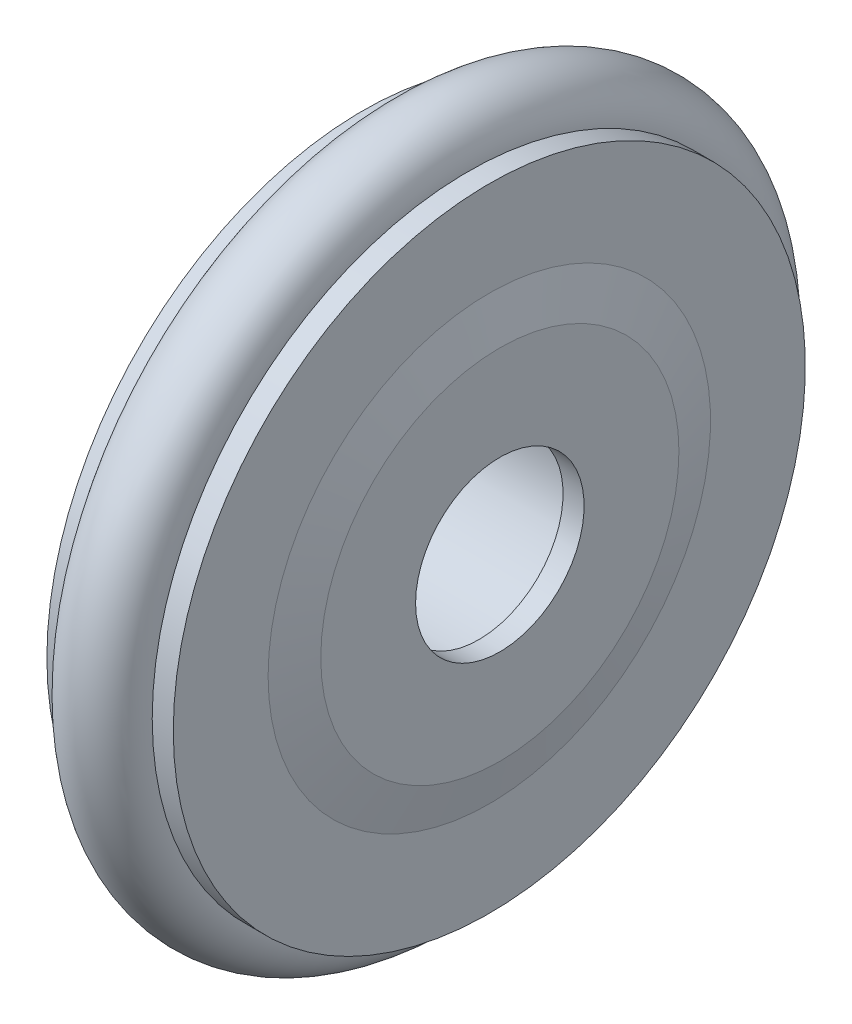
ISO-10303-21;
HEADER;
FILE_DESCRIPTION(('STEP AP214'),'2;1');
FILE_NAME('part.step','',(''),(''),'','','');
FILE_SCHEMA(('AUTOMOTIVE_DESIGN { 1 0 10303 214 1 1 1 1 }'));
ENDSEC;
DATA;
#1=APPLICATION_CONTEXT('core data for automotive mechanical design processes');
#2=APPLICATION_PROTOCOL_DEFINITION('international standard','automotive_design',2000,#1);
#3=PRODUCT_CONTEXT('',#1,'mechanical');
#4=PRODUCT('Part','Part','',(#3));
#5=PRODUCT_RELATED_PRODUCT_CATEGORY('part','',(#4));
#6=PRODUCT_DEFINITION_FORMATION('','',#4);
#7=PRODUCT_DEFINITION_CONTEXT('part definition',#1,'design');
#8=PRODUCT_DEFINITION('design','',#6,#7);
#9=PRODUCT_DEFINITION_SHAPE('','',#8);
#10=(LENGTH_UNIT() NAMED_UNIT(*) SI_UNIT(.MILLI.,.METRE.));
#11=(NAMED_UNIT(*) PLANE_ANGLE_UNIT() SI_UNIT($,.RADIAN.));
#12=(NAMED_UNIT(*) SI_UNIT($,.STERADIAN.) SOLID_ANGLE_UNIT());
#13=UNCERTAINTY_MEASURE_WITH_UNIT(LENGTH_MEASURE(1.E-05),#10,'distance_accuracy_value','');
#14=(GEOMETRIC_REPRESENTATION_CONTEXT(3) GLOBAL_UNCERTAINTY_ASSIGNED_CONTEXT((#13)) GLOBAL_UNIT_ASSIGNED_CONTEXT((#10,
#11,#12)) REPRESENTATION_CONTEXT('',''));
#15=CARTESIAN_POINT('',(0.,0.,0.));
#16=DIRECTION('',(0.,0.,1.));
#17=DIRECTION('',(1.,0.,0.));
#18=AXIS2_PLACEMENT_3D('',#15,#16,#17);
#19=CARTESIAN_POINT('',(3.,0.,0.));
#20=DIRECTION('',(-1.,0.,0.));
#21=DIRECTION('',(0.,0.,1.));
#22=AXIS2_PLACEMENT_3D('',#19,#20,#21);
#23=TOROIDAL_SURFACE('',#22,15.,1.95);
#24=CARTESIAN_POINT('',(3.,0.,16.95));
#25=VERTEX_POINT('',#24);
#26=VERTEX_LOOP('',#25);
#27=FACE_BOUND('',#26,.T.);
#28=ADVANCED_FACE('F41',(#27),#23,.T.);
#29=CLOSED_SHELL('',(#28));
#30=MANIFOLD_SOLID_BREP('B2',#29);
#31=CARTESIAN_POINT('',(0.,0.,0.));
#32=DIRECTION('',(-1.,0.,0.));
#33=DIRECTION('',(0.,0.,1.));
#34=AXIS2_PLACEMENT_3D('',#31,#32,#33);
#35=CYLINDRICAL_SURFACE('',#34,4.);
#36=CARTESIAN_POINT('',(6.5,0.,0.));
#37=DIRECTION('',(-1.,0.,0.));
#38=DIRECTION('',(0.,0.,1.));
#39=AXIS2_PLACEMENT_3D('',#36,#37,#38);
#40=CIRCLE('',#39,4.);
#41=CARTESIAN_POINT('',(6.5,0.,4.));
#42=VERTEX_POINT('',#41);
#43=EDGE_CURVE('E40',#42,#42,#40,.T.);
#44=ORIENTED_EDGE('',*,*,#43,.F.);
#45=EDGE_LOOP('',(#44));
#46=FACE_BOUND('',#45,.T.);
#47=CARTESIAN_POINT('',(5.5,0.,0.));
#48=DIRECTION('',(-1.,0.,0.));
#49=DIRECTION('',(0.,0.,1.));
#50=AXIS2_PLACEMENT_3D('',#47,#48,#49);
#51=CIRCLE('',#50,4.);
#52=CARTESIAN_POINT('',(5.5,0.,4.));
#53=VERTEX_POINT('',#52);
#54=EDGE_CURVE('E90',#53,#53,#51,.T.);
#55=ORIENTED_EDGE('',*,*,#54,.T.);
#56=EDGE_LOOP('',(#55));
#57=FACE_BOUND('',#56,.T.);
#58=ADVANCED_FACE('F56',(#46,#57),#35,.F.);
#59=CARTESIAN_POINT('',(6.5,8.5,0.));
#60=DIRECTION('',(-1.,0.,0.));
#61=DIRECTION('',(0.,0.,1.));
#62=AXIS2_PLACEMENT_3D('',#59,#60,#61);
#63=PLANE('',#62);
#64=CARTESIAN_POINT('',(6.5,0.,0.));
#65=DIRECTION('',(-1.,0.,0.));
#66=DIRECTION('',(0.,0.,1.));
#67=AXIS2_PLACEMENT_3D('',#64,#65,#66);
#68=CIRCLE('',#67,8.5);
#69=CARTESIAN_POINT('',(6.5,0.,8.5));
#70=VERTEX_POINT('',#69);
#71=EDGE_CURVE('E62',#70,#70,#68,.T.);
#72=ORIENTED_EDGE('',*,*,#71,.F.);
#73=EDGE_LOOP('',(#72));
#74=FACE_BOUND('',#73,.T.);
#75=ORIENTED_EDGE('',*,*,#43,.T.);
#76=EDGE_LOOP('',(#75));
#77=FACE_BOUND('',#76,.T.);
#78=ADVANCED_FACE('F139',(#74,#77),#63,.F.);
#79=CARTESIAN_POINT('',(6.5,0.,0.));
#80=DIRECTION('',(-1.,0.,0.));
#81=DIRECTION('',(0.,0.,1.));
#82=AXIS2_PLACEMENT_3D('',#79,#80,#81);
#83=CONICAL_SURFACE('',#82,8.5,1.32581766366803);
#84=CARTESIAN_POINT('',(6.,0.,0.));
#85=DIRECTION('',(-1.,0.,0.));
#86=DIRECTION('',(0.,0.,1.));
#87=AXIS2_PLACEMENT_3D('',#84,#85,#86);
#88=CIRCLE('',#87,10.5);
#89=CARTESIAN_POINT('',(6.,0.,10.5));
#90=VERTEX_POINT('',#89);
#91=EDGE_CURVE('E66',#90,#90,#88,.T.);
#92=ORIENTED_EDGE('',*,*,#91,.F.);
#93=EDGE_LOOP('',(#92));
#94=FACE_BOUND('',#93,.T.);
#95=ORIENTED_EDGE('',*,*,#71,.T.);
#96=EDGE_LOOP('',(#95));
#97=FACE_BOUND('',#96,.T.);
#98=ADVANCED_FACE('F134',(#94,#97),#83,.T.);
#99=CARTESIAN_POINT('',(6.,15.,0.));
#100=DIRECTION('',(-1.,0.,0.));
#101=DIRECTION('',(0.,0.,1.));
#102=AXIS2_PLACEMENT_3D('',#99,#100,#101);
#103=PLANE('',#102);
#104=CARTESIAN_POINT('',(6.,0.,0.));
#105=DIRECTION('',(-1.,0.,0.));
#106=DIRECTION('',(0.,0.,1.));
#107=AXIS2_PLACEMENT_3D('',#104,#105,#106);
#108=CIRCLE('',#107,15.);
#109=CARTESIAN_POINT('',(6.,0.,15.));
#110=VERTEX_POINT('',#109);
#111=EDGE_CURVE('E70',#110,#110,#108,.T.);
#112=ORIENTED_EDGE('',*,*,#111,.F.);
#113=EDGE_LOOP('',(#112));
#114=FACE_BOUND('',#113,.T.);
#115=ORIENTED_EDGE('',*,*,#91,.T.);
#116=EDGE_LOOP('',(#115));
#117=FACE_BOUND('',#116,.T.);
#118=ADVANCED_FACE('F128',(#114,#117),#103,.F.);
#119=CARTESIAN_POINT('',(0.,0.,0.));
#120=DIRECTION('',(-1.,0.,0.));
#121=DIRECTION('',(0.,0.,1.));
#122=AXIS2_PLACEMENT_3D('',#119,#120,#121);
#123=CYLINDRICAL_SURFACE('',#122,15.);
#124=CARTESIAN_POINT('',(5.,0.,0.));
#125=DIRECTION('',(-1.,0.,0.));
#126=DIRECTION('',(0.,0.,1.));
#127=AXIS2_PLACEMENT_3D('',#124,#125,#126);
#128=CIRCLE('',#127,15.);
#129=CARTESIAN_POINT('',(5.,0.,15.));
#130=VERTEX_POINT('',#129);
#131=EDGE_CURVE('E75',#130,#130,#128,.T.);
#132=ORIENTED_EDGE('',*,*,#131,.F.);
#133=EDGE_LOOP('',(#132));
#134=FACE_BOUND('',#133,.T.);
#135=ORIENTED_EDGE('',*,*,#111,.T.);
#136=EDGE_LOOP('',(#135));
#137=FACE_BOUND('',#136,.T.);
#138=ADVANCED_FACE('F122',(#134,#137),#123,.T.);
#139=CARTESIAN_POINT('',(3.,0.,0.));
#140=DIRECTION('',(-1.,0.,0.));
#141=DIRECTION('',(0.,0.,1.));
#142=AXIS2_PLACEMENT_3D('',#139,#140,#141);
#143=TOROIDAL_SURFACE('',#142,15.,2.);
#144=CARTESIAN_POINT('',(0.999999999999999,0.,0.));
#145=DIRECTION('',(-1.,0.,0.));
#146=DIRECTION('',(0.,0.,1.));
#147=AXIS2_PLACEMENT_3D('',#144,#145,#146);
#148=CIRCLE('',#147,15.);
#149=CARTESIAN_POINT('',(0.999999999999999,0.,15.));
#150=VERTEX_POINT('',#149);
#151=EDGE_CURVE('E78',#150,#150,#148,.T.);
#152=ORIENTED_EDGE('',*,*,#151,.F.);
#153=EDGE_LOOP('',(#152));
#154=FACE_BOUND('',#153,.T.);
#155=ORIENTED_EDGE('',*,*,#131,.T.);
#156=EDGE_LOOP('',(#155));
#157=FACE_BOUND('',#156,.T.);
#158=ADVANCED_FACE('F116',(#154,#157),#143,.F.);
#159=CARTESIAN_POINT('',(0.,0.,0.));
#160=DIRECTION('',(-1.,0.,0.));
#161=DIRECTION('',(0.,0.,1.));
#162=AXIS2_PLACEMENT_3D('',#159,#160,#161);
#163=CYLINDRICAL_SURFACE('',#162,15.);
#164=CARTESIAN_POINT('',(0.,0.,0.));
#165=DIRECTION('',(-1.,0.,0.));
#166=DIRECTION('',(0.,0.,1.));
#167=AXIS2_PLACEMENT_3D('',#164,#165,#166);
#168=CIRCLE('',#167,15.);
#169=CARTESIAN_POINT('',(0.,0.,15.));
#170=VERTEX_POINT('',#169);
#171=EDGE_CURVE('E81',#170,#170,#168,.T.);
#172=ORIENTED_EDGE('',*,*,#171,.F.);
#173=EDGE_LOOP('',(#172));
#174=FACE_BOUND('',#173,.T.);
#175=ORIENTED_EDGE('',*,*,#151,.T.);
#176=EDGE_LOOP('',(#175));
#177=FACE_BOUND('',#176,.T.);
#178=ADVANCED_FACE('F110',(#174,#177),#163,.T.);
#179=CARTESIAN_POINT('',(0.,15.,0.));
#180=DIRECTION('',(1.,0.,0.));
#181=DIRECTION('',(0.,0.,-1.));
#182=AXIS2_PLACEMENT_3D('',#179,#180,#181);
#183=PLANE('',#182);
#184=CARTESIAN_POINT('',(0.,0.,0.));
#185=DIRECTION('',(-1.,0.,0.));
#186=DIRECTION('',(0.,0.,1.));
#187=AXIS2_PLACEMENT_3D('',#184,#185,#186);
#188=CIRCLE('',#187,5.1);
#189=CARTESIAN_POINT('',(0.,0.,5.1));
#190=VERTEX_POINT('',#189);
#191=EDGE_CURVE('E84',#190,#190,#188,.T.);
#192=ORIENTED_EDGE('',*,*,#191,.F.);
#193=EDGE_LOOP('',(#192));
#194=FACE_BOUND('',#193,.T.);
#195=ORIENTED_EDGE('',*,*,#171,.T.);
#196=EDGE_LOOP('',(#195));
#197=FACE_BOUND('',#196,.T.);
#198=ADVANCED_FACE('F104',(#194,#197),#183,.F.);
#199=CARTESIAN_POINT('',(0.,0.,0.));
#200=DIRECTION('',(-1.,0.,0.));
#201=DIRECTION('',(0.,0.,1.));
#202=AXIS2_PLACEMENT_3D('',#199,#200,#201);
#203=CYLINDRICAL_SURFACE('',#202,5.1);
#204=CARTESIAN_POINT('',(5.5,0.,0.));
#205=DIRECTION('',(-1.,0.,0.));
#206=DIRECTION('',(0.,0.,1.));
#207=AXIS2_PLACEMENT_3D('',#204,#205,#206);
#208=CIRCLE('',#207,5.1);
#209=CARTESIAN_POINT('',(5.5,0.,5.1));
#210=VERTEX_POINT('',#209);
#211=EDGE_CURVE('E87',#210,#210,#208,.T.);
#212=ORIENTED_EDGE('',*,*,#211,.F.);
#213=EDGE_LOOP('',(#212));
#214=FACE_BOUND('',#213,.T.);
#215=ORIENTED_EDGE('',*,*,#191,.T.);
#216=EDGE_LOOP('',(#215));
#217=FACE_BOUND('',#216,.T.);
#218=ADVANCED_FACE('F98',(#214,#217),#203,.F.);
#219=CARTESIAN_POINT('',(5.5,5.1,0.));
#220=DIRECTION('',(1.,0.,0.));
#221=DIRECTION('',(0.,0.,-1.));
#222=AXIS2_PLACEMENT_3D('',#219,#220,#221);
#223=PLANE('',#222);
#224=ORIENTED_EDGE('',*,*,#54,.F.);
#225=EDGE_LOOP('',(#224));
#226=FACE_BOUND('',#225,.T.);
#227=ORIENTED_EDGE('',*,*,#211,.T.);
#228=EDGE_LOOP('',(#227));
#229=FACE_BOUND('',#228,.T.);
#230=ADVANCED_FACE('F95',(#226,#229),#223,.F.);
#231=CLOSED_SHELL('',(#58,#78,#98,#118,#138,#158,#178,#198,#218,#230));
#232=MANIFOLD_SOLID_BREP('B6',#231);
#233=ADVANCED_BREP_SHAPE_REPRESENTATION('',(#18,#30,#232),#14);
#234=SHAPE_DEFINITION_REPRESENTATION(#9,#233);
ENDSEC;
END-ISO-10303-21;
